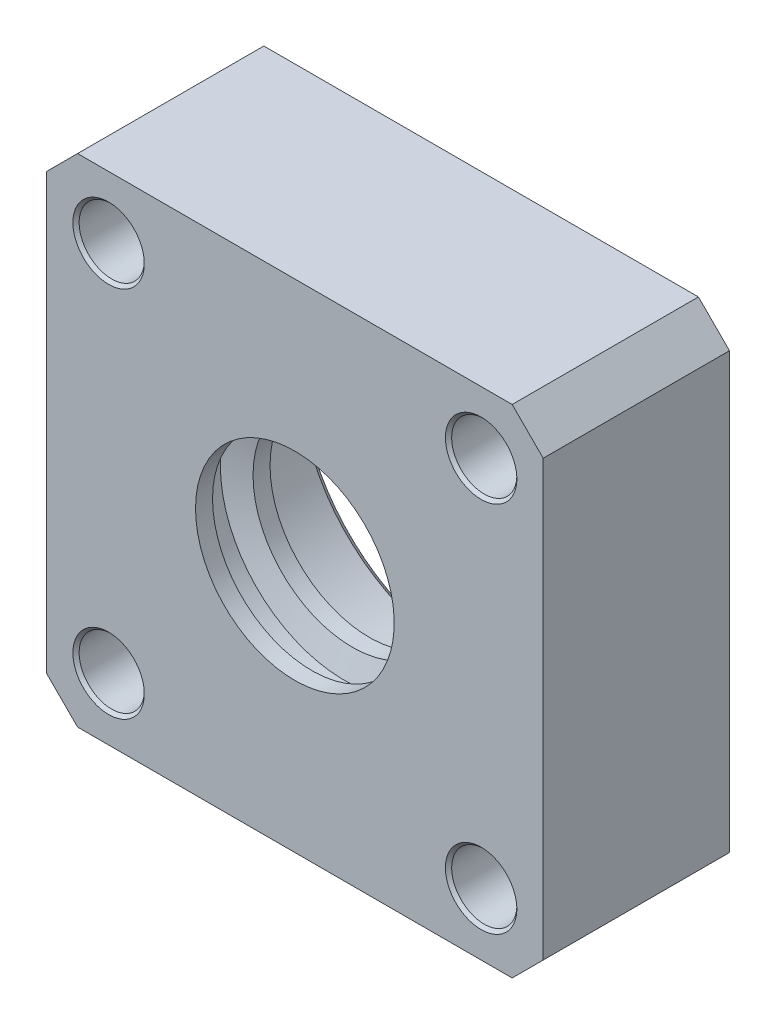
ISO-10303-21;
HEADER;
FILE_DESCRIPTION(('STEP AP214'),'2;1');
FILE_NAME('part.step','',(''),(''),'','','');
FILE_SCHEMA(('AUTOMOTIVE_DESIGN { 1 0 10303 214 1 1 1 1 }'));
ENDSEC;
DATA;
#1=APPLICATION_CONTEXT('core data for automotive mechanical design processes');
#2=APPLICATION_PROTOCOL_DEFINITION('international standard','automotive_design',2000,#1);
#3=PRODUCT_CONTEXT('',#1,'mechanical');
#4=PRODUCT('Part','Part','',(#3));
#5=PRODUCT_RELATED_PRODUCT_CATEGORY('part','',(#4));
#6=PRODUCT_DEFINITION_FORMATION('','',#4);
#7=PRODUCT_DEFINITION_CONTEXT('part definition',#1,'design');
#8=PRODUCT_DEFINITION('design','',#6,#7);
#9=PRODUCT_DEFINITION_SHAPE('','',#8);
#10=(LENGTH_UNIT() NAMED_UNIT(*) SI_UNIT(.MILLI.,.METRE.));
#11=(NAMED_UNIT(*) PLANE_ANGLE_UNIT() SI_UNIT($,.RADIAN.));
#12=(NAMED_UNIT(*) SI_UNIT($,.STERADIAN.) SOLID_ANGLE_UNIT());
#13=UNCERTAINTY_MEASURE_WITH_UNIT(LENGTH_MEASURE(1.E-05),#10,'distance_accuracy_value','');
#14=(GEOMETRIC_REPRESENTATION_CONTEXT(3) GLOBAL_UNCERTAINTY_ASSIGNED_CONTEXT((#13)) GLOBAL_UNIT_ASSIGNED_CONTEXT((#10,
#11,#12)) REPRESENTATION_CONTEXT('',''));
#15=CARTESIAN_POINT('',(0.,0.,0.));
#16=DIRECTION('',(0.,0.,1.));
#17=DIRECTION('',(1.,0.,0.));
#18=AXIS2_PLACEMENT_3D('',#15,#16,#17);
#19=CARTESIAN_POINT('',(-30.,-30.,26.6412718173193));
#20=DIRECTION('',(-1.,0.,0.));
#21=DIRECTION('',(0.,0.,1.));
#22=AXIS2_PLACEMENT_3D('',#19,#20,#21);
#23=PLANE('',#22);
#24=DIRECTION('',(0.,1.,0.));
#25=VECTOR('',#24,1.);
#26=CARTESIAN_POINT('',(-30.,-30.,26.6412718173193));
#27=LINE('',#26,#25);
#28=CARTESIAN_POINT('',(-30.,-26.25,26.6412718173193));
#29=VERTEX_POINT('',#28);
#30=CARTESIAN_POINT('',(-30.,26.25,26.6412718173193));
#31=VERTEX_POINT('',#30);
#32=EDGE_CURVE('E300',#29,#31,#27,.T.);
#33=ORIENTED_EDGE('',*,*,#32,.T.);
#34=DIRECTION('',(0.,0.,-1.));
#35=VECTOR('',#34,1.);
#36=CARTESIAN_POINT('',(-30.,26.25,26.6412718173193));
#37=LINE('',#36,#35);
#38=CARTESIAN_POINT('',(-30.,26.25,4.14127181731929));
#39=VERTEX_POINT('',#38);
#40=EDGE_CURVE('E153',#31,#39,#37,.T.);
#41=ORIENTED_EDGE('',*,*,#40,.T.);
#42=DIRECTION('',(0.,1.,0.));
#43=VECTOR('',#42,1.);
#44=CARTESIAN_POINT('',(-30.,-30.,4.14127181731929));
#45=LINE('',#44,#43);
#46=CARTESIAN_POINT('',(-30.,-26.25,4.14127181731929));
#47=VERTEX_POINT('',#46);
#48=EDGE_CURVE('E293',#47,#39,#45,.T.);
#49=ORIENTED_EDGE('',*,*,#48,.F.);
#50=DIRECTION('',(0.,0.,1.));
#51=VECTOR('',#50,1.);
#52=CARTESIAN_POINT('',(-30.,-26.25,26.6412718173193));
#53=LINE('',#52,#51);
#54=EDGE_CURVE('E151',#47,#29,#53,.T.);
#55=ORIENTED_EDGE('',*,*,#54,.T.);
#56=EDGE_LOOP('',(#33,#41,#49,#55));
#57=FACE_BOUND('',#56,.T.);
#58=ADVANCED_FACE('F35',(#57),#23,.T.);
#59=CARTESIAN_POINT('',(30.,-30.,26.6412718173193));
#60=DIRECTION('',(0.,-1.,0.));
#61=DIRECTION('',(0.,0.,-1.));
#62=AXIS2_PLACEMENT_3D('',#59,#60,#61);
#63=PLANE('',#62);
#64=DIRECTION('',(-1.,0.,0.));
#65=VECTOR('',#64,1.);
#66=CARTESIAN_POINT('',(30.,-30.,4.14127181731929));
#67=LINE('',#66,#65);
#68=CARTESIAN_POINT('',(26.25,-30.,4.14127181731929));
#69=VERTEX_POINT('',#68);
#70=CARTESIAN_POINT('',(-26.25,-30.,4.14127181731929));
#71=VERTEX_POINT('',#70);
#72=EDGE_CURVE('E121',#69,#71,#67,.T.);
#73=ORIENTED_EDGE('',*,*,#72,.F.);
#74=DIRECTION('',(0.,0.,1.));
#75=VECTOR('',#74,1.);
#76=CARTESIAN_POINT('',(26.25,-30.,26.6412718173193));
#77=LINE('',#76,#75);
#78=CARTESIAN_POINT('',(26.25,-30.,26.6412718173193));
#79=VERTEX_POINT('',#78);
#80=EDGE_CURVE('E139',#69,#79,#77,.T.);
#81=ORIENTED_EDGE('',*,*,#80,.T.);
#82=DIRECTION('',(-1.,0.,0.));
#83=VECTOR('',#82,1.);
#84=CARTESIAN_POINT('',(30.,-30.,26.6412718173193));
#85=LINE('',#84,#83);
#86=CARTESIAN_POINT('',(-26.25,-30.,26.6412718173193));
#87=VERTEX_POINT('',#86);
#88=EDGE_CURVE('E124',#79,#87,#85,.T.);
#89=ORIENTED_EDGE('',*,*,#88,.T.);
#90=DIRECTION('',(0.,0.,-1.));
#91=VECTOR('',#90,1.);
#92=CARTESIAN_POINT('',(-26.25,-30.,26.6412718173193));
#93=LINE('',#92,#91);
#94=EDGE_CURVE('E136',#87,#71,#93,.T.);
#95=ORIENTED_EDGE('',*,*,#94,.T.);
#96=EDGE_LOOP('',(#73,#81,#89,#95));
#97=FACE_BOUND('',#96,.T.);
#98=ADVANCED_FACE('F219',(#97),#63,.T.);
#99=CARTESIAN_POINT('',(30.,30.,26.6412718173193));
#100=DIRECTION('',(1.,0.,0.));
#101=DIRECTION('',(0.,0.,-1.));
#102=AXIS2_PLACEMENT_3D('',#99,#100,#101);
#103=PLANE('',#102);
#104=DIRECTION('',(0.,-1.,0.));
#105=VECTOR('',#104,1.);
#106=CARTESIAN_POINT('',(30.,30.,26.6412718173193));
#107=LINE('',#106,#105);
#108=CARTESIAN_POINT('',(30.,26.25,26.6412718173193));
#109=VERTEX_POINT('',#108);
#110=CARTESIAN_POINT('',(30.,-26.25,26.6412718173193));
#111=VERTEX_POINT('',#110);
#112=EDGE_CURVE('E129',#109,#111,#107,.T.);
#113=ORIENTED_EDGE('',*,*,#112,.T.);
#114=DIRECTION('',(0.,0.,-1.));
#115=VECTOR('',#114,1.);
#116=CARTESIAN_POINT('',(30.,-26.25,26.6412718173193));
#117=LINE('',#116,#115);
#118=CARTESIAN_POINT('',(30.,-26.25,4.14127181731929));
#119=VERTEX_POINT('',#118);
#120=EDGE_CURVE('E120',#111,#119,#117,.T.);
#121=ORIENTED_EDGE('',*,*,#120,.T.);
#122=DIRECTION('',(0.,-1.,0.));
#123=VECTOR('',#122,1.);
#124=CARTESIAN_POINT('',(30.,30.,4.14127181731929));
#125=LINE('',#124,#123);
#126=CARTESIAN_POINT('',(30.,26.25,4.14127181731929));
#127=VERTEX_POINT('',#126);
#128=EDGE_CURVE('E105',#127,#119,#125,.T.);
#129=ORIENTED_EDGE('',*,*,#128,.F.);
#130=DIRECTION('',(0.,0.,1.));
#131=VECTOR('',#130,1.);
#132=CARTESIAN_POINT('',(30.,26.25,26.6412718173193));
#133=LINE('',#132,#131);
#134=EDGE_CURVE('E118',#127,#109,#133,.T.);
#135=ORIENTED_EDGE('',*,*,#134,.T.);
#136=EDGE_LOOP('',(#113,#121,#129,#135));
#137=FACE_BOUND('',#136,.T.);
#138=ADVANCED_FACE('F117',(#137),#103,.T.);
#139=CARTESIAN_POINT('',(-30.,30.,26.6412718173193));
#140=DIRECTION('',(0.,1.,0.));
#141=DIRECTION('',(0.,0.,1.));
#142=AXIS2_PLACEMENT_3D('',#139,#140,#141);
#143=PLANE('',#142);
#144=DIRECTION('',(1.,0.,0.));
#145=VECTOR('',#144,1.);
#146=CARTESIAN_POINT('',(-30.,30.,26.6412718173193));
#147=LINE('',#146,#145);
#148=CARTESIAN_POINT('',(-26.25,30.,26.6412718173193));
#149=VERTEX_POINT('',#148);
#150=CARTESIAN_POINT('',(26.25,30.,26.6412718173193));
#151=VERTEX_POINT('',#150);
#152=EDGE_CURVE('E302',#149,#151,#147,.T.);
#153=ORIENTED_EDGE('',*,*,#152,.T.);
#154=DIRECTION('',(0.,0.,-1.));
#155=VECTOR('',#154,1.);
#156=CARTESIAN_POINT('',(26.25,30.,26.6412718173193));
#157=LINE('',#156,#155);
#158=CARTESIAN_POINT('',(26.25,30.,4.14127181731929));
#159=VERTEX_POINT('',#158);
#160=EDGE_CURVE('E149',#151,#159,#157,.T.);
#161=ORIENTED_EDGE('',*,*,#160,.T.);
#162=DIRECTION('',(1.,0.,0.));
#163=VECTOR('',#162,1.);
#164=CARTESIAN_POINT('',(-30.,30.,4.14127181731929));
#165=LINE('',#164,#163);
#166=CARTESIAN_POINT('',(-26.25,30.,4.14127181731929));
#167=VERTEX_POINT('',#166);
#168=EDGE_CURVE('E106',#167,#159,#165,.T.);
#169=ORIENTED_EDGE('',*,*,#168,.F.);
#170=DIRECTION('',(0.,0.,1.));
#171=VECTOR('',#170,1.);
#172=CARTESIAN_POINT('',(-26.25,30.,26.6412718173193));
#173=LINE('',#172,#171);
#174=EDGE_CURVE('E57',#167,#149,#173,.T.);
#175=ORIENTED_EDGE('',*,*,#174,.T.);
#176=EDGE_LOOP('',(#153,#161,#169,#175));
#177=FACE_BOUND('',#176,.T.);
#178=ADVANCED_FACE('F230',(#177),#143,.T.);
#179=CARTESIAN_POINT('',(0.,0.,26.6412718173193));
#180=DIRECTION('',(0.,0.,-1.));
#181=DIRECTION('',(-1.,0.,0.));
#182=AXIS2_PLACEMENT_3D('',#179,#180,#181);
#183=PLANE('',#182);
#184=CARTESIAN_POINT('',(22.5,-22.5,26.6412718173193));
#185=DIRECTION('',(0.,0.,-1.));
#186=DIRECTION('',(-1.,0.,0.));
#187=AXIS2_PLACEMENT_3D('',#184,#185,#186);
#188=CIRCLE('',#187,4.31250000001238);
#189=CARTESIAN_POINT('',(18.1874999999876,-22.5,26.6412718173193));
#190=VERTEX_POINT('',#189);
#191=EDGE_CURVE('E165',#190,#190,#188,.T.);
#192=ORIENTED_EDGE('',*,*,#191,.T.);
#193=EDGE_LOOP('',(#192));
#194=FACE_BOUND('',#193,.T.);
#195=CARTESIAN_POINT('',(-22.5,22.5,26.6412718173193));
#196=DIRECTION('',(0.,0.,-1.));
#197=DIRECTION('',(-1.,0.,0.));
#198=AXIS2_PLACEMENT_3D('',#195,#196,#197);
#199=CIRCLE('',#198,4.3125000000124);
#200=CARTESIAN_POINT('',(-26.8125000000124,22.5,26.6412718173193));
#201=VERTEX_POINT('',#200);
#202=EDGE_CURVE('E162',#201,#201,#199,.T.);
#203=ORIENTED_EDGE('',*,*,#202,.T.);
#204=EDGE_LOOP('',(#203));
#205=FACE_BOUND('',#204,.T.);
#206=CARTESIAN_POINT('',(-22.5,-22.5,26.6412718173193));
#207=DIRECTION('',(0.,0.,-1.));
#208=DIRECTION('',(-1.,0.,0.));
#209=AXIS2_PLACEMENT_3D('',#206,#207,#208);
#210=CIRCLE('',#209,4.31249999996977);
#211=CARTESIAN_POINT('',(-26.8124999999698,-22.5,26.6412718173193));
#212=VERTEX_POINT('',#211);
#213=EDGE_CURVE('E159',#212,#212,#210,.T.);
#214=ORIENTED_EDGE('',*,*,#213,.T.);
#215=EDGE_LOOP('',(#214));
#216=FACE_BOUND('',#215,.T.);
#217=CARTESIAN_POINT('',(22.5,22.5,26.6412718173193));
#218=DIRECTION('',(0.,0.,-1.));
#219=DIRECTION('',(-1.,0.,0.));
#220=AXIS2_PLACEMENT_3D('',#217,#218,#219);
#221=CIRCLE('',#220,4.31249999996977);
#222=CARTESIAN_POINT('',(18.1875000000302,22.5,26.6412718173193));
#223=VERTEX_POINT('',#222);
#224=EDGE_CURVE('E156',#223,#223,#221,.T.);
#225=ORIENTED_EDGE('',*,*,#224,.T.);
#226=EDGE_LOOP('',(#225));
#227=FACE_BOUND('',#226,.T.);
#228=CARTESIAN_POINT('',(0.,0.,26.6412718173193));
#229=DIRECTION('',(0.,0.,-1.));
#230=DIRECTION('',(-1.,0.,0.));
#231=AXIS2_PLACEMENT_3D('',#228,#229,#230);
#232=CIRCLE('',#231,12.);
#233=CARTESIAN_POINT('',(-12.,0.,26.6412718173193));
#234=VERTEX_POINT('',#233);
#235=EDGE_CURVE('E416',#234,#234,#232,.T.);
#236=ORIENTED_EDGE('',*,*,#235,.T.);
#237=EDGE_LOOP('',(#236));
#238=FACE_BOUND('',#237,.T.);
#239=ORIENTED_EDGE('',*,*,#88,.F.);
#240=DIRECTION('',(-0.70710678118655,-0.707106781186545,0.));
#241=VECTOR('',#240,1.);
#242=CARTESIAN_POINT('',(30.,-26.25,26.6412718173193));
#243=LINE('',#242,#241);
#244=EDGE_CURVE('E146',#79,#111,#243,.F.);
#245=ORIENTED_EDGE('',*,*,#244,.T.);
#246=ORIENTED_EDGE('',*,*,#112,.F.);
#247=DIRECTION('',(0.707106781186545,-0.70710678118655,0.));
#248=VECTOR('',#247,1.);
#249=CARTESIAN_POINT('',(26.25,30.,26.6412718173193));
#250=LINE('',#249,#248);
#251=EDGE_CURVE('E50',#109,#151,#250,.F.);
#252=ORIENTED_EDGE('',*,*,#251,.T.);
#253=ORIENTED_EDGE('',*,*,#152,.F.);
#254=DIRECTION('',(0.70710678118655,0.707106781186545,0.));
#255=VECTOR('',#254,1.);
#256=CARTESIAN_POINT('',(-30.,26.25,26.6412718173193));
#257=LINE('',#256,#255);
#258=EDGE_CURVE('E143',#149,#31,#257,.F.);
#259=ORIENTED_EDGE('',*,*,#258,.T.);
#260=ORIENTED_EDGE('',*,*,#32,.F.);
#261=DIRECTION('',(-0.707106781186545,0.70710678118655,0.));
#262=VECTOR('',#261,1.);
#263=CARTESIAN_POINT('',(-26.25,-30.,26.6412718173193));
#264=LINE('',#263,#262);
#265=EDGE_CURVE('E141',#29,#87,#264,.F.);
#266=ORIENTED_EDGE('',*,*,#265,.T.);
#267=EDGE_LOOP('',(#239,#245,#246,#252,#253,#259,#260,#266));
#268=FACE_BOUND('',#267,.T.);
#269=ADVANCED_FACE('F282',(#194,#205,#216,#227,#238,#268),#183,.F.);
#270=CARTESIAN_POINT('',(0.,0.,4.14127181731929));
#271=DIRECTION('',(0.,0.,-1.));
#272=DIRECTION('',(-1.,0.,0.));
#273=AXIS2_PLACEMENT_3D('',#270,#271,#272);
#274=PLANE('',#273);
#275=CARTESIAN_POINT('',(-22.5,22.5,4.14127181731929));
#276=DIRECTION('',(0.,0.,-1.));
#277=DIRECTION('',(-1.,0.,0.));
#278=AXIS2_PLACEMENT_3D('',#275,#276,#277);
#279=CIRCLE('',#278,4.31249999996975);
#280=CARTESIAN_POINT('',(-26.8124999999697,22.5,4.14127181731929));
#281=VERTEX_POINT('',#280);
#282=EDGE_CURVE('E189',#281,#281,#279,.F.);
#283=ORIENTED_EDGE('',*,*,#282,.T.);
#284=EDGE_LOOP('',(#283));
#285=FACE_BOUND('',#284,.T.);
#286=CARTESIAN_POINT('',(-22.5,-22.5,4.14127181731929));
#287=DIRECTION('',(0.,0.,-1.));
#288=DIRECTION('',(-1.,0.,0.));
#289=AXIS2_PLACEMENT_3D('',#286,#287,#288);
#290=CIRCLE('',#289,4.31250000001238);
#291=CARTESIAN_POINT('',(-26.8125000000124,-22.5,4.14127181731929));
#292=VERTEX_POINT('',#291);
#293=EDGE_CURVE('E186',#292,#292,#290,.F.);
#294=ORIENTED_EDGE('',*,*,#293,.T.);
#295=EDGE_LOOP('',(#294));
#296=FACE_BOUND('',#295,.T.);
#297=CARTESIAN_POINT('',(22.5,-22.5,4.14127181731929));
#298=DIRECTION('',(0.,0.,-1.));
#299=DIRECTION('',(-1.,0.,0.));
#300=AXIS2_PLACEMENT_3D('',#297,#298,#299);
#301=CIRCLE('',#300,4.31249999996975);
#302=CARTESIAN_POINT('',(18.1875000000303,-22.5,4.14127181731929));
#303=VERTEX_POINT('',#302);
#304=EDGE_CURVE('E183',#303,#303,#301,.F.);
#305=ORIENTED_EDGE('',*,*,#304,.T.);
#306=EDGE_LOOP('',(#305));
#307=FACE_BOUND('',#306,.T.);
#308=CARTESIAN_POINT('',(22.5,22.5,4.14127181731929));
#309=DIRECTION('',(0.,0.,-1.));
#310=DIRECTION('',(-1.,0.,0.));
#311=AXIS2_PLACEMENT_3D('',#308,#309,#310);
#312=CIRCLE('',#311,4.3125000000124);
#313=CARTESIAN_POINT('',(18.1874999999876,22.5,4.14127181731929));
#314=VERTEX_POINT('',#313);
#315=EDGE_CURVE('E180',#314,#314,#312,.F.);
#316=ORIENTED_EDGE('',*,*,#315,.T.);
#317=EDGE_LOOP('',(#316));
#318=FACE_BOUND('',#317,.T.);
#319=CARTESIAN_POINT('',(0.,0.,4.14127181731929));
#320=DIRECTION('',(0.,0.,-1.));
#321=DIRECTION('',(-1.,0.,0.));
#322=AXIS2_PLACEMENT_3D('',#319,#320,#321);
#323=CIRCLE('',#322,27.);
#324=CARTESIAN_POINT('',(-27.,0.,4.14127181731929));
#325=VERTEX_POINT('',#324);
#326=EDGE_CURVE('E287',#325,#325,#323,.T.);
#327=ORIENTED_EDGE('',*,*,#326,.F.);
#328=EDGE_LOOP('',(#327));
#329=FACE_BOUND('',#328,.T.);
#330=ORIENTED_EDGE('',*,*,#128,.T.);
#331=DIRECTION('',(0.70710678118655,0.707106781186545,0.));
#332=VECTOR('',#331,1.);
#333=CARTESIAN_POINT('',(28.1249999999999,-28.1250000000001,4.14127181731929));
#334=LINE('',#333,#332);
#335=EDGE_CURVE('E111',#119,#69,#334,.F.);
#336=ORIENTED_EDGE('',*,*,#335,.T.);
#337=ORIENTED_EDGE('',*,*,#72,.T.);
#338=DIRECTION('',(0.707106781186545,-0.70710678118655,0.));
#339=VECTOR('',#338,1.);
#340=CARTESIAN_POINT('',(-28.1250000000001,-28.1249999999999,4.14127181731929));
#341=LINE('',#340,#339);
#342=EDGE_CURVE('E126',#71,#47,#341,.F.);
#343=ORIENTED_EDGE('',*,*,#342,.T.);
#344=ORIENTED_EDGE('',*,*,#48,.T.);
#345=DIRECTION('',(-0.70710678118655,-0.707106781186545,0.));
#346=VECTOR('',#345,1.);
#347=CARTESIAN_POINT('',(-28.1249999999999,28.1250000000001,4.14127181731929));
#348=LINE('',#347,#346);
#349=EDGE_CURVE('E112',#39,#167,#348,.F.);
#350=ORIENTED_EDGE('',*,*,#349,.T.);
#351=ORIENTED_EDGE('',*,*,#168,.T.);
#352=DIRECTION('',(-0.707106781186545,0.70710678118655,0.));
#353=VECTOR('',#352,1.);
#354=CARTESIAN_POINT('',(28.1250000000001,28.1249999999999,4.14127181731929));
#355=LINE('',#354,#353);
#356=EDGE_CURVE('E102',#159,#127,#355,.F.);
#357=ORIENTED_EDGE('',*,*,#356,.T.);
#358=EDGE_LOOP('',(#330,#336,#337,#343,#344,#350,#351,#357));
#359=FACE_BOUND('',#358,.T.);
#360=ADVANCED_FACE('F104',(#285,#296,#307,#318,#329,#359),#274,.T.);
#361=CARTESIAN_POINT('',(0.,0.,5.64127181731929));
#362=DIRECTION('',(0.,0.,-1.));
#363=DIRECTION('',(-1.,0.,0.));
#364=AXIS2_PLACEMENT_3D('',#361,#362,#363);
#365=CYLINDRICAL_SURFACE('',#364,27.);
#366=CARTESIAN_POINT('',(0.,0.,5.64127181731929));
#367=DIRECTION('',(0.,0.,-1.));
#368=DIRECTION('',(-1.,0.,0.));
#369=AXIS2_PLACEMENT_3D('',#366,#367,#368);
#370=CIRCLE('',#369,27.);
#371=CARTESIAN_POINT('',(-27.,0.,5.64127181731929));
#372=VERTEX_POINT('',#371);
#373=EDGE_CURVE('E290',#372,#372,#370,.T.);
#374=ORIENTED_EDGE('',*,*,#373,.F.);
#375=EDGE_LOOP('',(#374));
#376=FACE_BOUND('',#375,.T.);
#377=ORIENTED_EDGE('',*,*,#326,.T.);
#378=EDGE_LOOP('',(#377));
#379=FACE_BOUND('',#378,.T.);
#380=ADVANCED_FACE('F281',(#376,#379),#365,.F.);
#381=CARTESIAN_POINT('',(27.,0.,5.64127181731929));
#382=DIRECTION('',(0.,0.,1.));
#383=DIRECTION('',(1.,0.,0.));
#384=AXIS2_PLACEMENT_3D('',#381,#382,#383);
#385=PLANE('',#384);
#386=CARTESIAN_POINT('',(0.,0.,5.64127181731929));
#387=DIRECTION('',(0.,0.,-1.));
#388=DIRECTION('',(-1.,0.,0.));
#389=AXIS2_PLACEMENT_3D('',#386,#387,#388);
#390=CIRCLE('',#389,24.75);
#391=CARTESIAN_POINT('',(-24.75,0.,5.64127181731929));
#392=VERTEX_POINT('',#391);
#393=EDGE_CURVE('E296',#392,#392,#390,.T.);
#394=ORIENTED_EDGE('',*,*,#393,.F.);
#395=EDGE_LOOP('',(#394));
#396=FACE_BOUND('',#395,.T.);
#397=ORIENTED_EDGE('',*,*,#373,.T.);
#398=EDGE_LOOP('',(#397));
#399=FACE_BOUND('',#398,.T.);
#400=ADVANCED_FACE('F333',(#396,#399),#385,.F.);
#401=CARTESIAN_POINT('',(0.,0.,7.44127181731924));
#402=DIRECTION('',(0.,0.,1.));
#403=DIRECTION('',(1.,0.,0.));
#404=AXIS2_PLACEMENT_3D('',#401,#402,#403);
#405=PLANE('',#404);
#406=CARTESIAN_POINT('',(0.,0.,7.44127181731929));
#407=DIRECTION('',(0.,0.,-1.));
#408=DIRECTION('',(-1.,0.,0.));
#409=AXIS2_PLACEMENT_3D('',#406,#407,#408);
#410=CIRCLE('',#409,22.5);
#411=CARTESIAN_POINT('',(-22.5,0.,7.44127181731929));
#412=VERTEX_POINT('',#411);
#413=EDGE_CURVE('E421',#412,#412,#410,.T.);
#414=ORIENTED_EDGE('',*,*,#413,.F.);
#415=EDGE_LOOP('',(#414));
#416=FACE_BOUND('',#415,.T.);
#417=CARTESIAN_POINT('',(0.,0.,7.44127181731929));
#418=DIRECTION('',(0.,0.,-1.));
#419=DIRECTION('',(-1.,0.,0.));
#420=AXIS2_PLACEMENT_3D('',#417,#418,#419);
#421=CIRCLE('',#420,24.75);
#422=CARTESIAN_POINT('',(-24.75,0.,7.44127181731929));
#423=VERTEX_POINT('',#422);
#424=EDGE_CURVE('E289',#423,#423,#421,.T.);
#425=ORIENTED_EDGE('',*,*,#424,.T.);
#426=EDGE_LOOP('',(#425));
#427=FACE_BOUND('',#426,.T.);
#428=ADVANCED_FACE('F329',(#416,#427),#405,.F.);
#429=CARTESIAN_POINT('',(0.,0.,4.14127181731929));
#430=DIRECTION('',(0.,0.,-1.));
#431=DIRECTION('',(-1.,0.,0.));
#432=AXIS2_PLACEMENT_3D('',#429,#430,#431);
#433=CYLINDRICAL_SURFACE('',#432,24.75);
#434=ORIENTED_EDGE('',*,*,#393,.T.);
#435=EDGE_LOOP('',(#434));
#436=FACE_BOUND('',#435,.T.);
#437=ORIENTED_EDGE('',*,*,#424,.F.);
#438=EDGE_LOOP('',(#437));
#439=FACE_BOUND('',#438,.T.);
#440=ADVANCED_FACE('F332',(#436,#439),#433,.F.);
#441=CARTESIAN_POINT('',(0.,0.,7.44127181731929));
#442=DIRECTION('',(0.,0.,-1.));
#443=DIRECTION('',(-1.,0.,0.));
#444=AXIS2_PLACEMENT_3D('',#441,#442,#443);
#445=CYLINDRICAL_SURFACE('',#444,22.5);
#446=ORIENTED_EDGE('',*,*,#413,.T.);
#447=EDGE_LOOP('',(#446));
#448=FACE_BOUND('',#447,.T.);
#449=CARTESIAN_POINT('',(0.,0.,5.64127181731929));
#450=DIRECTION('',(0.,0.,-1.));
#451=DIRECTION('',(-1.,0.,0.));
#452=AXIS2_PLACEMENT_3D('',#449,#450,#451);
#453=CIRCLE('',#452,22.5);
#454=CARTESIAN_POINT('',(-22.5,0.,5.64127181731929));
#455=VERTEX_POINT('',#454);
#456=EDGE_CURVE('E417',#455,#455,#453,.T.);
#457=ORIENTED_EDGE('',*,*,#456,.F.);
#458=EDGE_LOOP('',(#457));
#459=FACE_BOUND('',#458,.T.);
#460=ADVANCED_FACE('F337',(#448,#459),#445,.T.);
#461=CARTESIAN_POINT('',(0.,0.,5.64127181731929));
#462=DIRECTION('',(0.,0.,-1.));
#463=DIRECTION('',(-1.,0.,0.));
#464=AXIS2_PLACEMENT_3D('',#461,#462,#463);
#465=PLANE('',#464);
#466=CARTESIAN_POINT('',(0.,0.,5.64127181731929));
#467=DIRECTION('',(0.,0.,-1.));
#468=DIRECTION('',(-1.,0.,0.));
#469=AXIS2_PLACEMENT_3D('',#466,#467,#468);
#470=CIRCLE('',#469,20.3999999999999);
#471=CARTESIAN_POINT('',(-20.3999999999999,0.,5.64127181731929));
#472=VERTEX_POINT('',#471);
#473=EDGE_CURVE('E11',#472,#472,#470,.F.);
#474=ORIENTED_EDGE('',*,*,#473,.T.);
#475=EDGE_LOOP('',(#474));
#476=FACE_BOUND('',#475,.T.);
#477=ORIENTED_EDGE('',*,*,#456,.T.);
#478=EDGE_LOOP('',(#477));
#479=FACE_BOUND('',#478,.T.);
#480=ADVANCED_FACE('F347',(#476,#479),#465,.T.);
#481=CARTESIAN_POINT('',(0.,0.,26.6412718173193));
#482=DIRECTION('',(0.,0.,-1.));
#483=DIRECTION('',(-1.,0.,0.));
#484=AXIS2_PLACEMENT_3D('',#481,#482,#483);
#485=CYLINDRICAL_SURFACE('',#484,12.);
#486=ORIENTED_EDGE('',*,*,#235,.F.);
#487=EDGE_LOOP('',(#486));
#488=FACE_BOUND('',#487,.T.);
#489=CARTESIAN_POINT('',(0.,0.,24.5871681839593));
#490=DIRECTION('',(0.,0.,-1.));
#491=DIRECTION('',(-1.,0.,0.));
#492=AXIS2_PLACEMENT_3D('',#489,#490,#491);
#493=CIRCLE('',#492,12.);
#494=CARTESIAN_POINT('',(-12.,0.,24.5871681839593));
#495=VERTEX_POINT('',#494);
#496=EDGE_CURVE('E457',#495,#495,#493,.T.);
#497=ORIENTED_EDGE('',*,*,#496,.T.);
#498=EDGE_LOOP('',(#497));
#499=FACE_BOUND('',#498,.T.);
#500=ADVANCED_FACE('F351',(#488,#499),#485,.F.);
#501=CARTESIAN_POINT('',(0.,0.,26.6412718173193));
#502=DIRECTION('',(0.,0.,-1.));
#503=DIRECTION('',(-1.,0.,0.));
#504=AXIS2_PLACEMENT_3D('',#501,#502,#503);
#505=CYLINDRICAL_SURFACE('',#504,19.5);
#506=CARTESIAN_POINT('',(0.,0.,6.54127181731942));
#507=DIRECTION('',(0.,0.,-1.));
#508=DIRECTION('',(-1.,0.,0.));
#509=AXIS2_PLACEMENT_3D('',#506,#507,#508);
#510=CIRCLE('',#509,19.5);
#511=CARTESIAN_POINT('',(-19.5,0.,6.54127181731942));
#512=VERTEX_POINT('',#511);
#513=EDGE_CURVE('E43',#512,#512,#510,.T.);
#514=ORIENTED_EDGE('',*,*,#513,.T.);
#515=EDGE_LOOP('',(#514));
#516=FACE_BOUND('',#515,.T.);
#517=CARTESIAN_POINT('',(0.,0.,16.8912718173193));
#518=DIRECTION('',(0.,0.,-1.));
#519=DIRECTION('',(-1.,0.,0.));
#520=AXIS2_PLACEMENT_3D('',#517,#518,#519);
#521=CIRCLE('',#520,19.5);
#522=CARTESIAN_POINT('',(-19.5,0.,16.8912718173193));
#523=VERTEX_POINT('',#522);
#524=EDGE_CURVE('E418',#523,#523,#521,.T.);
#525=ORIENTED_EDGE('',*,*,#524,.F.);
#526=EDGE_LOOP('',(#525));
#527=FACE_BOUND('',#526,.T.);
#528=ADVANCED_FACE('F206',(#516,#527),#505,.F.);
#529=CARTESIAN_POINT('',(19.5,0.,16.8912718173193));
#530=DIRECTION('',(0.,0.,1.));
#531=DIRECTION('',(1.,0.,0.));
#532=AXIS2_PLACEMENT_3D('',#529,#530,#531);
#533=PLANE('',#532);
#534=CARTESIAN_POINT('',(0.,0.,16.8912718173193));
#535=DIRECTION('',(0.,0.,-1.));
#536=DIRECTION('',(-1.,0.,0.));
#537=AXIS2_PLACEMENT_3D('',#534,#535,#536);
#538=CIRCLE('',#537,16.5);
#539=CARTESIAN_POINT('',(-16.5,0.,16.8912718173193));
#540=VERTEX_POINT('',#539);
#541=EDGE_CURVE('E424',#540,#540,#538,.T.);
#542=ORIENTED_EDGE('',*,*,#541,.F.);
#543=EDGE_LOOP('',(#542));
#544=FACE_BOUND('',#543,.T.);
#545=ORIENTED_EDGE('',*,*,#524,.T.);
#546=EDGE_LOOP('',(#545));
#547=FACE_BOUND('',#546,.T.);
#548=ADVANCED_FACE('F358',(#544,#547),#533,.F.);
#549=CARTESIAN_POINT('',(0.,0.,26.6412718173193));
#550=DIRECTION('',(0.,0.,-1.));
#551=DIRECTION('',(-1.,0.,0.));
#552=AXIS2_PLACEMENT_3D('',#549,#550,#551);
#553=CYLINDRICAL_SURFACE('',#552,16.5);
#554=CARTESIAN_POINT('',(0.,0.,17.6412718173193));
#555=DIRECTION('',(0.,0.,-1.));
#556=DIRECTION('',(-1.,0.,0.));
#557=AXIS2_PLACEMENT_3D('',#554,#555,#556);
#558=CIRCLE('',#557,16.5);
#559=CARTESIAN_POINT('',(-16.5,0.,17.6412718173193));
#560=VERTEX_POINT('',#559);
#561=EDGE_CURVE('E442',#560,#560,#558,.T.);
#562=ORIENTED_EDGE('',*,*,#561,.F.);
#563=EDGE_LOOP('',(#562));
#564=FACE_BOUND('',#563,.T.);
#565=ORIENTED_EDGE('',*,*,#541,.T.);
#566=EDGE_LOOP('',(#565));
#567=FACE_BOUND('',#566,.T.);
#568=ADVANCED_FACE('F361',(#564,#567),#553,.F.);
#569=CARTESIAN_POINT('',(16.5,0.,17.6412718173193));
#570=DIRECTION('',(0.,0.,1.));
#571=DIRECTION('',(1.,0.,0.));
#572=AXIS2_PLACEMENT_3D('',#569,#570,#571);
#573=PLANE('',#572);
#574=CARTESIAN_POINT('',(0.,0.,17.6412718173193));
#575=DIRECTION('',(0.,0.,-1.));
#576=DIRECTION('',(-1.,0.,0.));
#577=AXIS2_PLACEMENT_3D('',#574,#575,#576);
#578=CIRCLE('',#577,12.);
#579=CARTESIAN_POINT('',(-12.,0.,17.6412718173193));
#580=VERTEX_POINT('',#579);
#581=EDGE_CURVE('E445',#580,#580,#578,.T.);
#582=ORIENTED_EDGE('',*,*,#581,.F.);
#583=EDGE_LOOP('',(#582));
#584=FACE_BOUND('',#583,.T.);
#585=ORIENTED_EDGE('',*,*,#561,.T.);
#586=EDGE_LOOP('',(#585));
#587=FACE_BOUND('',#586,.T.);
#588=ADVANCED_FACE('F365',(#584,#587),#573,.F.);
#589=CARTESIAN_POINT('',(0.,0.,26.6412718173193));
#590=DIRECTION('',(0.,0.,-1.));
#591=DIRECTION('',(-1.,0.,0.));
#592=AXIS2_PLACEMENT_3D('',#589,#590,#591);
#593=CYLINDRICAL_SURFACE('',#592,12.);
#594=CARTESIAN_POINT('',(0.,0.,19.6953754506803));
#595=DIRECTION('',(0.,0.,-1.));
#596=DIRECTION('',(-1.,0.,0.));
#597=AXIS2_PLACEMENT_3D('',#594,#595,#596);
#598=CIRCLE('',#597,12.);
#599=CARTESIAN_POINT('',(-12.,0.,19.6953754506803));
#600=VERTEX_POINT('',#599);
#601=EDGE_CURVE('E448',#600,#600,#598,.T.);
#602=ORIENTED_EDGE('',*,*,#601,.F.);
#603=EDGE_LOOP('',(#602));
#604=FACE_BOUND('',#603,.T.);
#605=ORIENTED_EDGE('',*,*,#581,.T.);
#606=EDGE_LOOP('',(#605));
#607=FACE_BOUND('',#606,.T.);
#608=ADVANCED_FACE('F369',(#604,#607),#593,.F.);
#609=CARTESIAN_POINT('',(0.,0.,19.6953754506803));
#610=DIRECTION('',(0.,0.,1.));
#611=DIRECTION('',(1.,0.,0.));
#612=AXIS2_PLACEMENT_3D('',#609,#610,#611);
#613=CONICAL_SURFACE('',#612,12.,1.26536370769562);
#614=CARTESIAN_POINT('',(0.,0.,20.6412718173182));
#615=DIRECTION('',(0.,0.,-1.));
#616=DIRECTION('',(-1.,0.,0.));
#617=AXIS2_PLACEMENT_3D('',#614,#615,#616);
#618=CIRCLE('',#617,15.);
#619=CARTESIAN_POINT('',(-15.,0.,20.6412718173182));
#620=VERTEX_POINT('',#619);
#621=EDGE_CURVE('E451',#620,#620,#618,.T.);
#622=ORIENTED_EDGE('',*,*,#621,.F.);
#623=EDGE_LOOP('',(#622));
#624=FACE_BOUND('',#623,.T.);
#625=ORIENTED_EDGE('',*,*,#601,.T.);
#626=EDGE_LOOP('',(#625));
#627=FACE_BOUND('',#626,.T.);
#628=ADVANCED_FACE('F373',(#624,#627),#613,.F.);
#629=CARTESIAN_POINT('',(0.,0.,26.6412718173193));
#630=DIRECTION('',(0.,0.,-1.));
#631=DIRECTION('',(-1.,0.,0.));
#632=AXIS2_PLACEMENT_3D('',#629,#630,#631);
#633=CYLINDRICAL_SURFACE('',#632,15.);
#634=CARTESIAN_POINT('',(0.,0.,23.6412718173203));
#635=DIRECTION('',(0.,0.,-1.));
#636=DIRECTION('',(-1.,0.,0.));
#637=AXIS2_PLACEMENT_3D('',#634,#635,#636);
#638=CIRCLE('',#637,15.);
#639=CARTESIAN_POINT('',(-15.,0.,23.6412718173203));
#640=VERTEX_POINT('',#639);
#641=EDGE_CURVE('E454',#640,#640,#638,.T.);
#642=ORIENTED_EDGE('',*,*,#641,.F.);
#643=EDGE_LOOP('',(#642));
#644=FACE_BOUND('',#643,.T.);
#645=ORIENTED_EDGE('',*,*,#621,.T.);
#646=EDGE_LOOP('',(#645));
#647=FACE_BOUND('',#646,.T.);
#648=ADVANCED_FACE('F377',(#644,#647),#633,.F.);
#649=CARTESIAN_POINT('',(0.,0.,23.6412718173203));
#650=DIRECTION('',(0.,0.,-1.));
#651=DIRECTION('',(-1.,0.,0.));
#652=AXIS2_PLACEMENT_3D('',#649,#650,#651);
#653=CONICAL_SURFACE('',#652,15.,1.26536370769528);
#654=ORIENTED_EDGE('',*,*,#496,.F.);
#655=EDGE_LOOP('',(#654));
#656=FACE_BOUND('',#655,.T.);
#657=ORIENTED_EDGE('',*,*,#641,.T.);
#658=EDGE_LOOP('',(#657));
#659=FACE_BOUND('',#658,.T.);
#660=ADVANCED_FACE('F381',(#656,#659),#653,.F.);
#661=CARTESIAN_POINT('',(22.5,22.5,26.6412718173193));
#662=DIRECTION('',(0.,0.,1.));
#663=DIRECTION('',(1.,0.,0.));
#664=AXIS2_PLACEMENT_3D('',#661,#662,#663);
#665=CYLINDRICAL_SURFACE('',#664,3.93749999999999);
#666=CARTESIAN_POINT('',(22.5,22.5,4.51627181728906));
#667=DIRECTION('',(0.,0.,-1.));
#668=DIRECTION('',(-1.,0.,0.));
#669=AXIS2_PLACEMENT_3D('',#666,#667,#668);
#670=CIRCLE('',#669,3.93749999999999);
#671=CARTESIAN_POINT('',(18.5625,22.5,4.51627181728906));
#672=VERTEX_POINT('',#671);
#673=EDGE_CURVE('E201',#672,#672,#670,.T.);
#674=ORIENTED_EDGE('',*,*,#673,.T.);
#675=EDGE_LOOP('',(#674));
#676=FACE_BOUND('',#675,.T.);
#677=CARTESIAN_POINT('',(22.5,22.5,26.2662718173069));
#678=DIRECTION('',(0.,0.,-1.));
#679=DIRECTION('',(-1.,0.,0.));
#680=AXIS2_PLACEMENT_3D('',#677,#678,#679);
#681=CIRCLE('',#680,3.93749999999999);
#682=CARTESIAN_POINT('',(18.5625,22.5,26.2662718173069));
#683=VERTEX_POINT('',#682);
#684=EDGE_CURVE('E198',#683,#683,#681,.F.);
#685=ORIENTED_EDGE('',*,*,#684,.T.);
#686=EDGE_LOOP('',(#685));
#687=FACE_BOUND('',#686,.T.);
#688=ADVANCED_FACE('F385',(#676,#687),#665,.F.);
#689=CARTESIAN_POINT('',(-22.5,-22.5,26.6412718173193));
#690=DIRECTION('',(0.,0.,1.));
#691=DIRECTION('',(1.,0.,0.));
#692=AXIS2_PLACEMENT_3D('',#689,#690,#691);
#693=CYLINDRICAL_SURFACE('',#692,3.93749999999999);
#694=CARTESIAN_POINT('',(-22.5,-22.5,4.51627181728904));
#695=DIRECTION('',(0.,0.,-1.));
#696=DIRECTION('',(-1.,0.,0.));
#697=AXIS2_PLACEMENT_3D('',#694,#695,#696);
#698=CIRCLE('',#697,3.93749999999999);
#699=CARTESIAN_POINT('',(-26.4375,-22.5,4.51627181728904));
#700=VERTEX_POINT('',#699);
#701=EDGE_CURVE('E195',#700,#700,#698,.T.);
#702=ORIENTED_EDGE('',*,*,#701,.T.);
#703=EDGE_LOOP('',(#702));
#704=FACE_BOUND('',#703,.T.);
#705=CARTESIAN_POINT('',(-22.5,-22.5,26.2662718173069));
#706=DIRECTION('',(0.,0.,-1.));
#707=DIRECTION('',(-1.,0.,0.));
#708=AXIS2_PLACEMENT_3D('',#705,#706,#707);
#709=CIRCLE('',#708,3.93749999999999);
#710=CARTESIAN_POINT('',(-26.4375,-22.5,26.2662718173069));
#711=VERTEX_POINT('',#710);
#712=EDGE_CURVE('E192',#711,#711,#709,.F.);
#713=ORIENTED_EDGE('',*,*,#712,.T.);
#714=EDGE_LOOP('',(#713));
#715=FACE_BOUND('',#714,.T.);
#716=ADVANCED_FACE('F389',(#704,#715),#693,.F.);
#717=CARTESIAN_POINT('',(22.5,-22.5,4.14127181731929));
#718=DIRECTION('',(0.,0.,-1.));
#719=DIRECTION('',(-1.,0.,0.));
#720=AXIS2_PLACEMENT_3D('',#717,#718,#719);
#721=CYLINDRICAL_SURFACE('',#720,3.93749999999999);
#722=CARTESIAN_POINT('',(22.5,-22.5,26.2662718173495));
#723=DIRECTION('',(0.,0.,-1.));
#724=DIRECTION('',(-1.,0.,0.));
#725=AXIS2_PLACEMENT_3D('',#722,#723,#724);
#726=CIRCLE('',#725,3.93749999999999);
#727=CARTESIAN_POINT('',(18.5625,-22.5,26.2662718173495));
#728=VERTEX_POINT('',#727);
#729=EDGE_CURVE('E171',#728,#728,#726,.F.);
#730=ORIENTED_EDGE('',*,*,#729,.T.);
#731=EDGE_LOOP('',(#730));
#732=FACE_BOUND('',#731,.T.);
#733=CARTESIAN_POINT('',(22.5,-22.5,4.51627181733167));
#734=DIRECTION('',(0.,0.,-1.));
#735=DIRECTION('',(-1.,0.,0.));
#736=AXIS2_PLACEMENT_3D('',#733,#734,#735);
#737=CIRCLE('',#736,3.93749999999999);
#738=CARTESIAN_POINT('',(18.5625,-22.5,4.51627181733167));
#739=VERTEX_POINT('',#738);
#740=EDGE_CURVE('E168',#739,#739,#737,.T.);
#741=ORIENTED_EDGE('',*,*,#740,.T.);
#742=EDGE_LOOP('',(#741));
#743=FACE_BOUND('',#742,.T.);
#744=ADVANCED_FACE('F393',(#732,#743),#721,.F.);
#745=CARTESIAN_POINT('',(-22.5,22.5,4.14127181731929));
#746=DIRECTION('',(0.,0.,-1.));
#747=DIRECTION('',(-1.,0.,0.));
#748=AXIS2_PLACEMENT_3D('',#745,#746,#747);
#749=CYLINDRICAL_SURFACE('',#748,3.93749999999999);
#750=CARTESIAN_POINT('',(-22.5,22.5,26.2662718173495));
#751=DIRECTION('',(0.,0.,-1.));
#752=DIRECTION('',(-1.,0.,0.));
#753=AXIS2_PLACEMENT_3D('',#750,#751,#752);
#754=CIRCLE('',#753,3.93749999999999);
#755=CARTESIAN_POINT('',(-26.4375,22.5,26.2662718173495));
#756=VERTEX_POINT('',#755);
#757=EDGE_CURVE('E177',#756,#756,#754,.F.);
#758=ORIENTED_EDGE('',*,*,#757,.T.);
#759=EDGE_LOOP('',(#758));
#760=FACE_BOUND('',#759,.T.);
#761=CARTESIAN_POINT('',(-22.5,22.5,4.51627181733167));
#762=DIRECTION('',(0.,0.,-1.));
#763=DIRECTION('',(-1.,0.,0.));
#764=AXIS2_PLACEMENT_3D('',#761,#762,#763);
#765=CIRCLE('',#764,3.93749999999999);
#766=CARTESIAN_POINT('',(-26.4375,22.5,4.51627181733167));
#767=VERTEX_POINT('',#766);
#768=EDGE_CURVE('E174',#767,#767,#765,.T.);
#769=ORIENTED_EDGE('',*,*,#768,.T.);
#770=EDGE_LOOP('',(#769));
#771=FACE_BOUND('',#770,.T.);
#772=ADVANCED_FACE('F235',(#760,#771),#749,.F.);
#773=CARTESIAN_POINT('',(30.,-26.25,26.6412718173193));
#774=DIRECTION('',(-0.707106781186545,0.707106781186551,0.));
#775=DIRECTION('',(0.,0.,-1.));
#776=AXIS2_PLACEMENT_3D('',#773,#774,#775);
#777=PLANE('',#776);
#778=ORIENTED_EDGE('',*,*,#244,.F.);
#779=ORIENTED_EDGE('',*,*,#80,.F.);
#780=ORIENTED_EDGE('',*,*,#335,.F.);
#781=ORIENTED_EDGE('',*,*,#120,.F.);
#782=EDGE_LOOP('',(#778,#779,#780,#781));
#783=FACE_BOUND('',#782,.T.);
#784=ADVANCED_FACE('F232',(#783),#777,.F.);
#785=CARTESIAN_POINT('',(26.25,30.,26.6412718173193));
#786=DIRECTION('',(-0.707106781186551,-0.707106781186545,0.));
#787=DIRECTION('',(0.,0.,-1.));
#788=AXIS2_PLACEMENT_3D('',#785,#786,#787);
#789=PLANE('',#788);
#790=ORIENTED_EDGE('',*,*,#251,.F.);
#791=ORIENTED_EDGE('',*,*,#134,.F.);
#792=ORIENTED_EDGE('',*,*,#356,.F.);
#793=ORIENTED_EDGE('',*,*,#160,.F.);
#794=EDGE_LOOP('',(#790,#791,#792,#793));
#795=FACE_BOUND('',#794,.T.);
#796=ADVANCED_FACE('F123',(#795),#789,.F.);
#797=CARTESIAN_POINT('',(-30.,26.25,26.6412718173193));
#798=DIRECTION('',(0.707106781186545,-0.707106781186551,0.));
#799=DIRECTION('',(0.,0.,-1.));
#800=AXIS2_PLACEMENT_3D('',#797,#798,#799);
#801=PLANE('',#800);
#802=ORIENTED_EDGE('',*,*,#258,.F.);
#803=ORIENTED_EDGE('',*,*,#174,.F.);
#804=ORIENTED_EDGE('',*,*,#349,.F.);
#805=ORIENTED_EDGE('',*,*,#40,.F.);
#806=EDGE_LOOP('',(#802,#803,#804,#805));
#807=FACE_BOUND('',#806,.T.);
#808=ADVANCED_FACE('F239',(#807),#801,.F.);
#809=CARTESIAN_POINT('',(-26.25,-30.,26.6412718173193));
#810=DIRECTION('',(0.707106781186551,0.707106781186545,0.));
#811=DIRECTION('',(0.,0.,-1.));
#812=AXIS2_PLACEMENT_3D('',#809,#810,#811);
#813=PLANE('',#812);
#814=ORIENTED_EDGE('',*,*,#265,.F.);
#815=ORIENTED_EDGE('',*,*,#54,.F.);
#816=ORIENTED_EDGE('',*,*,#342,.F.);
#817=ORIENTED_EDGE('',*,*,#94,.F.);
#818=EDGE_LOOP('',(#814,#815,#816,#817));
#819=FACE_BOUND('',#818,.T.);
#820=ADVANCED_FACE('F242',(#819),#813,.F.);
#821=CARTESIAN_POINT('',(22.5,-22.5,26.6412718173193));
#822=DIRECTION('',(0.,0.,1.));
#823=DIRECTION('',(1.,0.,0.));
#824=AXIS2_PLACEMENT_3D('',#821,#822,#823);
#825=CONICAL_SURFACE('',#824,4.31250000001238,0.785398163454292);
#826=ORIENTED_EDGE('',*,*,#729,.F.);
#827=EDGE_LOOP('',(#826));
#828=FACE_BOUND('',#827,.T.);
#829=ORIENTED_EDGE('',*,*,#191,.F.);
#830=EDGE_LOOP('',(#829));
#831=FACE_BOUND('',#830,.T.);
#832=ADVANCED_FACE('F246',(#828,#831),#825,.F.);
#833=CARTESIAN_POINT('',(-22.5,22.5,26.6412718173193));
#834=DIRECTION('',(0.,0.,1.));
#835=DIRECTION('',(1.,0.,0.));
#836=AXIS2_PLACEMENT_3D('',#833,#834,#835);
#837=CONICAL_SURFACE('',#836,4.3125000000124,0.785398163454295);
#838=ORIENTED_EDGE('',*,*,#757,.F.);
#839=EDGE_LOOP('',(#838));
#840=FACE_BOUND('',#839,.T.);
#841=ORIENTED_EDGE('',*,*,#202,.F.);
#842=EDGE_LOOP('',(#841));
#843=FACE_BOUND('',#842,.T.);
#844=ADVANCED_FACE('F250',(#840,#843),#837,.F.);
#845=CARTESIAN_POINT('',(-22.5,22.5,4.51627181733167));
#846=DIRECTION('',(0.,0.,-1.));
#847=DIRECTION('',(-1.,0.,0.));
#848=AXIS2_PLACEMENT_3D('',#845,#846,#847);
#849=CONICAL_SURFACE('',#848,3.93749999999999,0.785398163340612);
#850=ORIENTED_EDGE('',*,*,#282,.F.);
#851=EDGE_LOOP('',(#850));
#852=FACE_BOUND('',#851,.T.);
#853=ORIENTED_EDGE('',*,*,#768,.F.);
#854=EDGE_LOOP('',(#853));
#855=FACE_BOUND('',#854,.T.);
#856=ADVANCED_FACE('F254',(#852,#855),#849,.F.);
#857=CARTESIAN_POINT('',(-22.5,-22.5,4.14127181731929));
#858=DIRECTION('',(0.,0.,-1.));
#859=DIRECTION('',(-1.,0.,0.));
#860=AXIS2_PLACEMENT_3D('',#857,#858,#859);
#861=CONICAL_SURFACE('',#860,4.31250000001238,0.785398163454292);
#862=ORIENTED_EDGE('',*,*,#701,.F.);
#863=EDGE_LOOP('',(#862));
#864=FACE_BOUND('',#863,.T.);
#865=ORIENTED_EDGE('',*,*,#293,.F.);
#866=EDGE_LOOP('',(#865));
#867=FACE_BOUND('',#866,.T.);
#868=ADVANCED_FACE('F258',(#864,#867),#861,.F.);
#869=CARTESIAN_POINT('',(22.5,-22.5,4.51627181733167));
#870=DIRECTION('',(0.,0.,-1.));
#871=DIRECTION('',(-1.,0.,0.));
#872=AXIS2_PLACEMENT_3D('',#869,#870,#871);
#873=CONICAL_SURFACE('',#872,3.93749999999999,0.785398163340612);
#874=ORIENTED_EDGE('',*,*,#304,.F.);
#875=EDGE_LOOP('',(#874));
#876=FACE_BOUND('',#875,.T.);
#877=ORIENTED_EDGE('',*,*,#740,.F.);
#878=EDGE_LOOP('',(#877));
#879=FACE_BOUND('',#878,.T.);
#880=ADVANCED_FACE('F262',(#876,#879),#873,.F.);
#881=CARTESIAN_POINT('',(-22.5,-22.5,26.2662718173069));
#882=DIRECTION('',(0.,0.,1.));
#883=DIRECTION('',(1.,0.,0.));
#884=AXIS2_PLACEMENT_3D('',#881,#882,#883);
#885=CONICAL_SURFACE('',#884,3.93749999999999,0.785398163340615);
#886=ORIENTED_EDGE('',*,*,#213,.F.);
#887=EDGE_LOOP('',(#886));
#888=FACE_BOUND('',#887,.T.);
#889=ORIENTED_EDGE('',*,*,#712,.F.);
#890=EDGE_LOOP('',(#889));
#891=FACE_BOUND('',#890,.T.);
#892=ADVANCED_FACE('F266',(#888,#891),#885,.F.);
#893=CARTESIAN_POINT('',(22.5,22.5,4.14127181731929));
#894=DIRECTION('',(0.,0.,-1.));
#895=DIRECTION('',(-1.,0.,0.));
#896=AXIS2_PLACEMENT_3D('',#893,#894,#895);
#897=CONICAL_SURFACE('',#896,4.3125000000124,0.785398163454295);
#898=ORIENTED_EDGE('',*,*,#673,.F.);
#899=EDGE_LOOP('',(#898));
#900=FACE_BOUND('',#899,.T.);
#901=ORIENTED_EDGE('',*,*,#315,.F.);
#902=EDGE_LOOP('',(#901));
#903=FACE_BOUND('',#902,.T.);
#904=ADVANCED_FACE('F215',(#900,#903),#897,.F.);
#905=CARTESIAN_POINT('',(22.5,22.5,26.2662718173069));
#906=DIRECTION('',(0.,0.,1.));
#907=DIRECTION('',(1.,0.,0.));
#908=AXIS2_PLACEMENT_3D('',#905,#906,#907);
#909=CONICAL_SURFACE('',#908,3.93749999999999,0.785398163340615);
#910=ORIENTED_EDGE('',*,*,#224,.F.);
#911=EDGE_LOOP('',(#910));
#912=FACE_BOUND('',#911,.T.);
#913=ORIENTED_EDGE('',*,*,#684,.F.);
#914=EDGE_LOOP('',(#913));
#915=FACE_BOUND('',#914,.T.);
#916=ADVANCED_FACE('F210',(#912,#915),#909,.F.);
#917=CARTESIAN_POINT('',(0.,0.,6.54127181731942));
#918=DIRECTION('',(0.,0.,-1.));
#919=DIRECTION('',(-1.,0.,0.));
#920=AXIS2_PLACEMENT_3D('',#917,#918,#919);
#921=CONICAL_SURFACE('',#920,19.5,0.785398163397302);
#922=ORIENTED_EDGE('',*,*,#473,.F.);
#923=EDGE_LOOP('',(#922));
#924=FACE_BOUND('',#923,.T.);
#925=ORIENTED_EDGE('',*,*,#513,.F.);
#926=EDGE_LOOP('',(#925));
#927=FACE_BOUND('',#926,.T.);
#928=ADVANCED_FACE('F37',(#924,#927),#921,.F.);
#929=CLOSED_SHELL('',(#58,#98,#138,#178,#269,#360,#380,#400,#428,#440,#460,#480,#500,#528,#548,
#568,#588,#608,#628,#648,#660,#688,#716,#744,#772,#784,#796,#808,#820,#832,#844,#856,#868,#880,
#892,#904,#916,#928));
#930=MANIFOLD_SOLID_BREP('B2',#929);
#931=ADVANCED_BREP_SHAPE_REPRESENTATION('',(#18,#930),#14);
#932=SHAPE_DEFINITION_REPRESENTATION(#9,#931);
ENDSEC;
END-ISO-10303-21;
